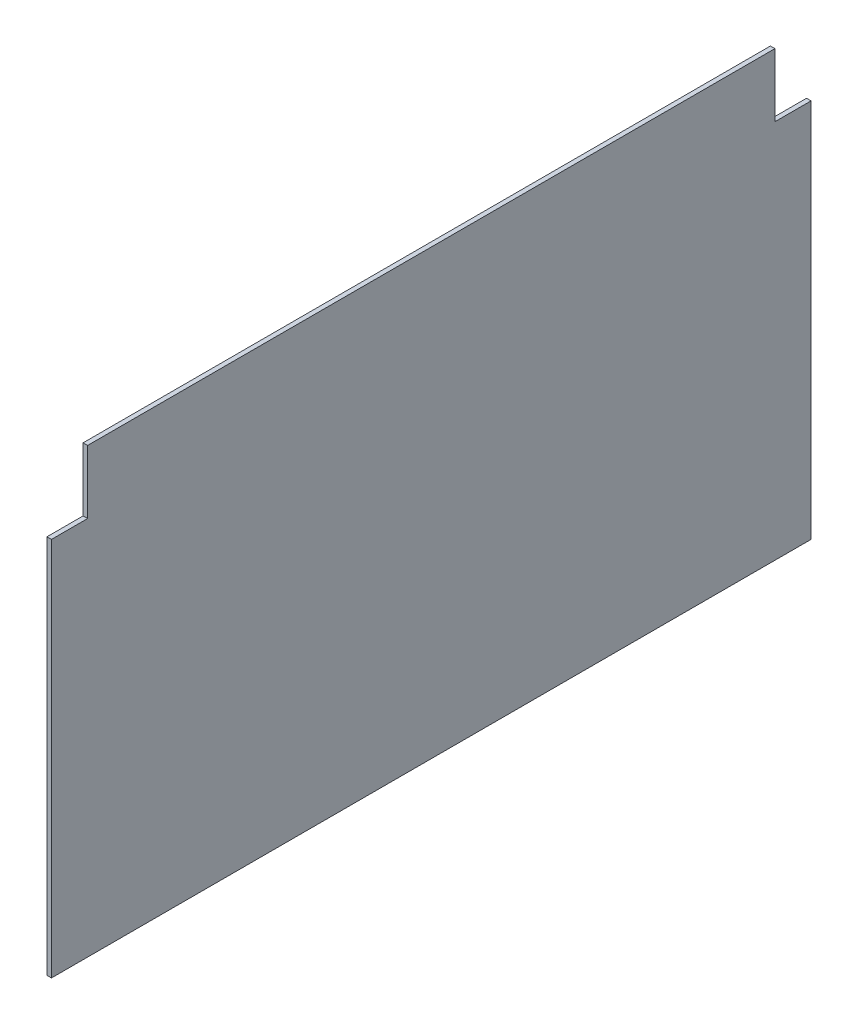
ISO-10303-21;
HEADER;
FILE_DESCRIPTION(('STEP AP214'),'2;1');
FILE_NAME('part.step','',(''),(''),'','','');
FILE_SCHEMA(('AUTOMOTIVE_DESIGN { 1 0 10303 214 1 1 1 1 }'));
ENDSEC;
DATA;
#1=APPLICATION_CONTEXT('core data for automotive mechanical design processes');
#2=APPLICATION_PROTOCOL_DEFINITION('international standard','automotive_design',2000,#1);
#3=PRODUCT_CONTEXT('',#1,'mechanical');
#4=PRODUCT('Part','Part','',(#3));
#5=PRODUCT_RELATED_PRODUCT_CATEGORY('part','',(#4));
#6=PRODUCT_DEFINITION_FORMATION('','',#4);
#7=PRODUCT_DEFINITION_CONTEXT('part definition',#1,'design');
#8=PRODUCT_DEFINITION('design','',#6,#7);
#9=PRODUCT_DEFINITION_SHAPE('','',#8);
#10=(LENGTH_UNIT() NAMED_UNIT(*) SI_UNIT(.MILLI.,.METRE.));
#11=(NAMED_UNIT(*) PLANE_ANGLE_UNIT() SI_UNIT($,.RADIAN.));
#12=(NAMED_UNIT(*) SI_UNIT($,.STERADIAN.) SOLID_ANGLE_UNIT());
#13=UNCERTAINTY_MEASURE_WITH_UNIT(LENGTH_MEASURE(1.E-05),#10,'distance_accuracy_value','');
#14=(GEOMETRIC_REPRESENTATION_CONTEXT(3) GLOBAL_UNCERTAINTY_ASSIGNED_CONTEXT((#13)) GLOBAL_UNIT_ASSIGNED_CONTEXT((#10,
#11,#12)) REPRESENTATION_CONTEXT('',''));
#15=CARTESIAN_POINT('',(0.,0.,0.));
#16=DIRECTION('',(0.,0.,1.));
#17=DIRECTION('',(1.,0.,0.));
#18=AXIS2_PLACEMENT_3D('',#15,#16,#17);
#19=CARTESIAN_POINT('',(6.35,0.,0.));
#20=DIRECTION('',(0.,0.,-1.));
#21=DIRECTION('',(-1.,0.,0.));
#22=AXIS2_PLACEMENT_3D('',#19,#20,#21);
#23=PLANE('',#22);
#24=DIRECTION('',(0.,-1.,0.));
#25=VECTOR('',#24,1.);
#26=CARTESIAN_POINT('',(0.,0.,0.));
#27=LINE('',#26,#25);
#28=CARTESIAN_POINT('',(0.,533.4,0.));
#29=VERTEX_POINT('',#28);
#30=CARTESIAN_POINT('',(0.,0.,0.));
#31=VERTEX_POINT('',#30);
#32=EDGE_CURVE('E133',#29,#31,#27,.T.);
#33=ORIENTED_EDGE('',*,*,#32,.T.);
#34=DIRECTION('',(-1.,0.,0.));
#35=VECTOR('',#34,1.);
#36=CARTESIAN_POINT('',(6.35,0.,0.));
#37=LINE('',#36,#35);
#38=CARTESIAN_POINT('',(6.35,0.,0.));
#39=VERTEX_POINT('',#38);
#40=EDGE_CURVE('E11',#39,#31,#37,.T.);
#41=ORIENTED_EDGE('',*,*,#40,.F.);
#42=DIRECTION('',(0.,-1.,0.));
#43=VECTOR('',#42,1.);
#44=CARTESIAN_POINT('',(6.35,0.,0.));
#45=LINE('',#44,#43);
#46=CARTESIAN_POINT('',(6.35,533.4,0.));
#47=VERTEX_POINT('',#46);
#48=EDGE_CURVE('E147',#47,#39,#45,.T.);
#49=ORIENTED_EDGE('',*,*,#48,.F.);
#50=DIRECTION('',(-1.,0.,0.));
#51=VECTOR('',#50,1.);
#52=CARTESIAN_POINT('',(6.35,533.4,0.));
#53=LINE('',#52,#51);
#54=EDGE_CURVE('E129',#47,#29,#53,.T.);
#55=ORIENTED_EDGE('',*,*,#54,.T.);
#56=EDGE_LOOP('',(#33,#41,#49,#55));
#57=FACE_BOUND('',#56,.T.);
#58=ADVANCED_FACE('F37',(#57),#23,.F.);
#59=CARTESIAN_POINT('',(6.35,0.,0.));
#60=DIRECTION('',(0.,1.,0.));
#61=DIRECTION('',(0.,0.,1.));
#62=AXIS2_PLACEMENT_3D('',#59,#60,#61);
#63=PLANE('',#62);
#64=DIRECTION('',(0.,0.,-1.));
#65=VECTOR('',#64,1.);
#66=CARTESIAN_POINT('',(0.,0.,0.));
#67=LINE('',#66,#65);
#68=CARTESIAN_POINT('',(0.,0.,-1066.8));
#69=VERTEX_POINT('',#68);
#70=EDGE_CURVE('E136',#31,#69,#67,.T.);
#71=ORIENTED_EDGE('',*,*,#70,.T.);
#72=DIRECTION('',(-1.,0.,0.));
#73=VECTOR('',#72,1.);
#74=CARTESIAN_POINT('',(6.35,0.,-1066.8));
#75=LINE('',#74,#73);
#76=CARTESIAN_POINT('',(6.35,0.,-1066.8));
#77=VERTEX_POINT('',#76);
#78=EDGE_CURVE('E45',#77,#69,#75,.T.);
#79=ORIENTED_EDGE('',*,*,#78,.F.);
#80=DIRECTION('',(0.,0.,-1.));
#81=VECTOR('',#80,1.);
#82=CARTESIAN_POINT('',(6.35,0.,0.));
#83=LINE('',#82,#81);
#84=EDGE_CURVE('E96',#39,#77,#83,.T.);
#85=ORIENTED_EDGE('',*,*,#84,.F.);
#86=ORIENTED_EDGE('',*,*,#40,.T.);
#87=EDGE_LOOP('',(#71,#79,#85,#86));
#88=FACE_BOUND('',#87,.T.);
#89=ADVANCED_FACE('F182',(#88),#63,.F.);
#90=CARTESIAN_POINT('',(6.35,0.,-1066.8));
#91=DIRECTION('',(0.,0.,1.));
#92=DIRECTION('',(1.,0.,0.));
#93=AXIS2_PLACEMENT_3D('',#90,#91,#92);
#94=PLANE('',#93);
#95=DIRECTION('',(0.,1.,0.));
#96=VECTOR('',#95,1.);
#97=CARTESIAN_POINT('',(0.,0.,-1066.8));
#98=LINE('',#97,#96);
#99=CARTESIAN_POINT('',(0.,533.4,-1066.8));
#100=VERTEX_POINT('',#99);
#101=EDGE_CURVE('E138',#69,#100,#98,.T.);
#102=ORIENTED_EDGE('',*,*,#101,.T.);
#103=DIRECTION('',(-1.,0.,0.));
#104=VECTOR('',#103,1.);
#105=CARTESIAN_POINT('',(6.35,533.4,-1066.8));
#106=LINE('',#105,#104);
#107=CARTESIAN_POINT('',(6.35,533.4,-1066.8));
#108=VERTEX_POINT('',#107);
#109=EDGE_CURVE('E154',#108,#100,#106,.T.);
#110=ORIENTED_EDGE('',*,*,#109,.F.);
#111=DIRECTION('',(0.,1.,0.));
#112=VECTOR('',#111,1.);
#113=CARTESIAN_POINT('',(6.35,0.,-1066.8));
#114=LINE('',#113,#112);
#115=EDGE_CURVE('E162',#77,#108,#114,.T.);
#116=ORIENTED_EDGE('',*,*,#115,.F.);
#117=ORIENTED_EDGE('',*,*,#78,.T.);
#118=EDGE_LOOP('',(#102,#110,#116,#117));
#119=FACE_BOUND('',#118,.T.);
#120=ADVANCED_FACE('F160',(#119),#94,.F.);
#121=CARTESIAN_POINT('',(6.35,533.4,-1016.));
#122=DIRECTION('',(0.,-1.,0.));
#123=DIRECTION('',(0.,0.,-1.));
#124=AXIS2_PLACEMENT_3D('',#121,#122,#123);
#125=PLANE('',#124);
#126=DIRECTION('',(0.,0.,1.));
#127=VECTOR('',#126,1.);
#128=CARTESIAN_POINT('',(0.,533.4,-1016.));
#129=LINE('',#128,#127);
#130=CARTESIAN_POINT('',(0.,533.4,-1016.));
#131=VERTEX_POINT('',#130);
#132=EDGE_CURVE('E140',#100,#131,#129,.T.);
#133=ORIENTED_EDGE('',*,*,#132,.T.);
#134=DIRECTION('',(-1.,0.,0.));
#135=VECTOR('',#134,1.);
#136=CARTESIAN_POINT('',(6.35,533.4,-1016.));
#137=LINE('',#136,#135);
#138=CARTESIAN_POINT('',(6.35,533.4,-1016.));
#139=VERTEX_POINT('',#138);
#140=EDGE_CURVE('E151',#139,#131,#137,.T.);
#141=ORIENTED_EDGE('',*,*,#140,.F.);
#142=DIRECTION('',(0.,0.,1.));
#143=VECTOR('',#142,1.);
#144=CARTESIAN_POINT('',(6.35,533.4,-1016.));
#145=LINE('',#144,#143);
#146=EDGE_CURVE('E174',#108,#139,#145,.T.);
#147=ORIENTED_EDGE('',*,*,#146,.F.);
#148=ORIENTED_EDGE('',*,*,#109,.T.);
#149=EDGE_LOOP('',(#133,#141,#147,#148));
#150=FACE_BOUND('',#149,.T.);
#151=ADVANCED_FACE('F170',(#150),#125,.F.);
#152=CARTESIAN_POINT('',(6.35,533.4,-1016.));
#153=DIRECTION('',(0.,0.,1.));
#154=DIRECTION('',(1.,0.,0.));
#155=AXIS2_PLACEMENT_3D('',#152,#153,#154);
#156=PLANE('',#155);
#157=DIRECTION('',(0.,1.,0.));
#158=VECTOR('',#157,1.);
#159=CARTESIAN_POINT('',(0.,533.4,-1016.));
#160=LINE('',#159,#158);
#161=CARTESIAN_POINT('',(0.,622.3,-1016.));
#162=VERTEX_POINT('',#161);
#163=EDGE_CURVE('E142',#131,#162,#160,.T.);
#164=ORIENTED_EDGE('',*,*,#163,.T.);
#165=DIRECTION('',(-1.,0.,0.));
#166=VECTOR('',#165,1.);
#167=CARTESIAN_POINT('',(6.35,622.3,-1016.));
#168=LINE('',#167,#166);
#169=CARTESIAN_POINT('',(6.35,622.3,-1016.));
#170=VERTEX_POINT('',#169);
#171=EDGE_CURVE('E124',#170,#162,#168,.T.);
#172=ORIENTED_EDGE('',*,*,#171,.F.);
#173=DIRECTION('',(0.,1.,0.));
#174=VECTOR('',#173,1.);
#175=CARTESIAN_POINT('',(6.35,533.4,-1016.));
#176=LINE('',#175,#174);
#177=EDGE_CURVE('E115',#139,#170,#176,.T.);
#178=ORIENTED_EDGE('',*,*,#177,.F.);
#179=ORIENTED_EDGE('',*,*,#140,.T.);
#180=EDGE_LOOP('',(#164,#172,#178,#179));
#181=FACE_BOUND('',#180,.T.);
#182=ADVANCED_FACE('F173',(#181),#156,.F.);
#183=CARTESIAN_POINT('',(6.35,622.3,-50.8));
#184=DIRECTION('',(0.,-1.,0.));
#185=DIRECTION('',(0.,0.,-1.));
#186=AXIS2_PLACEMENT_3D('',#183,#184,#185);
#187=PLANE('',#186);
#188=DIRECTION('',(0.,0.,1.));
#189=VECTOR('',#188,1.);
#190=CARTESIAN_POINT('',(0.,622.3,-50.8));
#191=LINE('',#190,#189);
#192=CARTESIAN_POINT('',(0.,622.3,-50.8));
#193=VERTEX_POINT('',#192);
#194=EDGE_CURVE('E123',#162,#193,#191,.T.);
#195=ORIENTED_EDGE('',*,*,#194,.T.);
#196=DIRECTION('',(-1.,0.,0.));
#197=VECTOR('',#196,1.);
#198=CARTESIAN_POINT('',(6.35,622.3,-50.8));
#199=LINE('',#198,#197);
#200=CARTESIAN_POINT('',(6.35,622.3,-50.8));
#201=VERTEX_POINT('',#200);
#202=EDGE_CURVE('E120',#201,#193,#199,.T.);
#203=ORIENTED_EDGE('',*,*,#202,.F.);
#204=DIRECTION('',(0.,0.,1.));
#205=VECTOR('',#204,1.);
#206=CARTESIAN_POINT('',(6.35,622.3,-50.8));
#207=LINE('',#206,#205);
#208=EDGE_CURVE('E109',#170,#201,#207,.T.);
#209=ORIENTED_EDGE('',*,*,#208,.F.);
#210=ORIENTED_EDGE('',*,*,#171,.T.);
#211=EDGE_LOOP('',(#195,#203,#209,#210));
#212=FACE_BOUND('',#211,.T.);
#213=ADVANCED_FACE('F121',(#212),#187,.F.);
#214=CARTESIAN_POINT('',(6.35,533.4,-50.8));
#215=DIRECTION('',(0.,0.,-1.));
#216=DIRECTION('',(-1.,0.,0.));
#217=AXIS2_PLACEMENT_3D('',#214,#215,#216);
#218=PLANE('',#217);
#219=DIRECTION('',(0.,-1.,0.));
#220=VECTOR('',#219,1.);
#221=CARTESIAN_POINT('',(0.,533.4,-50.8));
#222=LINE('',#221,#220);
#223=CARTESIAN_POINT('',(0.,533.4,-50.8));
#224=VERTEX_POINT('',#223);
#225=EDGE_CURVE('E82',#193,#224,#222,.T.);
#226=ORIENTED_EDGE('',*,*,#225,.T.);
#227=DIRECTION('',(-1.,0.,0.));
#228=VECTOR('',#227,1.);
#229=CARTESIAN_POINT('',(6.35,533.4,-50.8));
#230=LINE('',#229,#228);
#231=CARTESIAN_POINT('',(6.35,533.4,-50.8));
#232=VERTEX_POINT('',#231);
#233=EDGE_CURVE('E125',#232,#224,#230,.T.);
#234=ORIENTED_EDGE('',*,*,#233,.F.);
#235=DIRECTION('',(0.,-1.,0.));
#236=VECTOR('',#235,1.);
#237=CARTESIAN_POINT('',(6.35,533.4,-50.8));
#238=LINE('',#237,#236);
#239=EDGE_CURVE('E113',#201,#232,#238,.T.);
#240=ORIENTED_EDGE('',*,*,#239,.F.);
#241=ORIENTED_EDGE('',*,*,#202,.T.);
#242=EDGE_LOOP('',(#226,#234,#240,#241));
#243=FACE_BOUND('',#242,.T.);
#244=ADVANCED_FACE('F127',(#243),#218,.F.);
#245=CARTESIAN_POINT('',(6.35,533.4,0.));
#246=DIRECTION('',(0.,-1.,0.));
#247=DIRECTION('',(0.,0.,-1.));
#248=AXIS2_PLACEMENT_3D('',#245,#246,#247);
#249=PLANE('',#248);
#250=DIRECTION('',(0.,0.,1.));
#251=VECTOR('',#250,1.);
#252=CARTESIAN_POINT('',(0.,533.4,0.));
#253=LINE('',#252,#251);
#254=EDGE_CURVE('E88',#224,#29,#253,.T.);
#255=ORIENTED_EDGE('',*,*,#254,.T.);
#256=ORIENTED_EDGE('',*,*,#54,.F.);
#257=DIRECTION('',(0.,0.,1.));
#258=VECTOR('',#257,1.);
#259=CARTESIAN_POINT('',(6.35,533.4,0.));
#260=LINE('',#259,#258);
#261=EDGE_CURVE('E53',#232,#47,#260,.T.);
#262=ORIENTED_EDGE('',*,*,#261,.F.);
#263=ORIENTED_EDGE('',*,*,#233,.T.);
#264=EDGE_LOOP('',(#255,#256,#262,#263));
#265=FACE_BOUND('',#264,.T.);
#266=ADVANCED_FACE('F198',(#265),#249,.F.);
#267=CARTESIAN_POINT('',(6.35,0.,0.));
#268=DIRECTION('',(-1.,0.,0.));
#269=DIRECTION('',(0.,0.,1.));
#270=AXIS2_PLACEMENT_3D('',#267,#268,#269);
#271=PLANE('',#270);
#272=ORIENTED_EDGE('',*,*,#48,.T.);
#273=ORIENTED_EDGE('',*,*,#84,.T.);
#274=ORIENTED_EDGE('',*,*,#115,.T.);
#275=ORIENTED_EDGE('',*,*,#146,.T.);
#276=ORIENTED_EDGE('',*,*,#177,.T.);
#277=ORIENTED_EDGE('',*,*,#208,.T.);
#278=ORIENTED_EDGE('',*,*,#239,.T.);
#279=ORIENTED_EDGE('',*,*,#261,.T.);
#280=EDGE_LOOP('',(#272,#273,#274,#275,#276,#277,#278,#279));
#281=FACE_BOUND('',#280,.T.);
#282=ADVANCED_FACE('F111',(#281),#271,.F.);
#283=CARTESIAN_POINT('',(0.,0.,0.));
#284=DIRECTION('',(-1.,0.,0.));
#285=DIRECTION('',(0.,0.,1.));
#286=AXIS2_PLACEMENT_3D('',#283,#284,#285);
#287=PLANE('',#286);
#288=ORIENTED_EDGE('',*,*,#32,.F.);
#289=ORIENTED_EDGE('',*,*,#254,.F.);
#290=ORIENTED_EDGE('',*,*,#225,.F.);
#291=ORIENTED_EDGE('',*,*,#194,.F.);
#292=ORIENTED_EDGE('',*,*,#163,.F.);
#293=ORIENTED_EDGE('',*,*,#132,.F.);
#294=ORIENTED_EDGE('',*,*,#101,.F.);
#295=ORIENTED_EDGE('',*,*,#70,.F.);
#296=EDGE_LOOP('',(#288,#289,#290,#291,#292,#293,#294,#295));
#297=FACE_BOUND('',#296,.T.);
#298=ADVANCED_FACE('F166',(#297),#287,.T.);
#299=CLOSED_SHELL('',(#58,#89,#120,#151,#182,#213,#244,#266,#282,#298));
#300=MANIFOLD_SOLID_BREP('B2',#299);
#301=ADVANCED_BREP_SHAPE_REPRESENTATION('',(#18,#300),#14);
#302=SHAPE_DEFINITION_REPRESENTATION(#9,#301);
ENDSEC;
END-ISO-10303-21;
